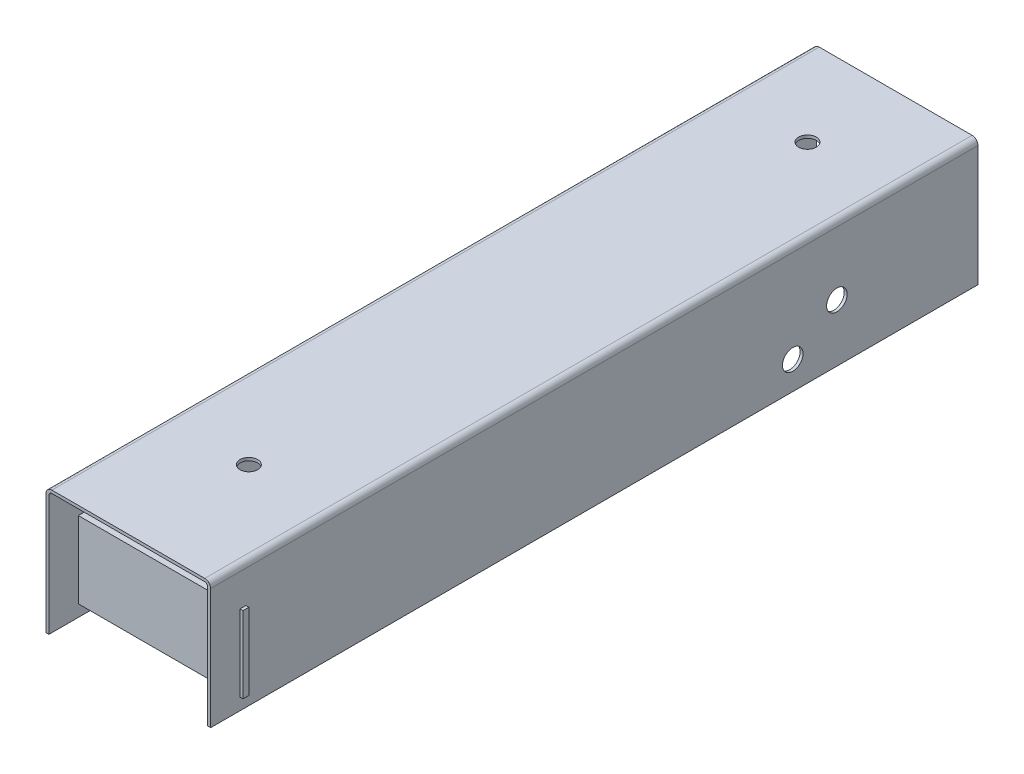
ISO-10303-21;
HEADER;
FILE_DESCRIPTION(('STEP AP214'),'2;1');
FILE_NAME('part.step','',(''),(''),'','','');
FILE_SCHEMA(('AUTOMOTIVE_DESIGN { 1 0 10303 214 1 1 1 1 }'));
ENDSEC;
DATA;
#1=APPLICATION_CONTEXT('core data for automotive mechanical design processes');
#2=APPLICATION_PROTOCOL_DEFINITION('international standard','automotive_design',2000,#1);
#3=PRODUCT_CONTEXT('',#1,'mechanical');
#4=PRODUCT('Part','Part','',(#3));
#5=PRODUCT_RELATED_PRODUCT_CATEGORY('part','',(#4));
#6=PRODUCT_DEFINITION_FORMATION('','',#4);
#7=PRODUCT_DEFINITION_CONTEXT('part definition',#1,'design');
#8=PRODUCT_DEFINITION('design','',#6,#7);
#9=PRODUCT_DEFINITION_SHAPE('','',#8);
#10=(LENGTH_UNIT() NAMED_UNIT(*) SI_UNIT(.MILLI.,.METRE.));
#11=(NAMED_UNIT(*) PLANE_ANGLE_UNIT() SI_UNIT($,.RADIAN.));
#12=(NAMED_UNIT(*) SI_UNIT($,.STERADIAN.) SOLID_ANGLE_UNIT());
#13=UNCERTAINTY_MEASURE_WITH_UNIT(LENGTH_MEASURE(1.E-05),#10,'distance_accuracy_value','');
#14=(GEOMETRIC_REPRESENTATION_CONTEXT(3) GLOBAL_UNCERTAINTY_ASSIGNED_CONTEXT((#13)) GLOBAL_UNIT_ASSIGNED_CONTEXT((#10,
#11,#12)) REPRESENTATION_CONTEXT('',''));
#15=CARTESIAN_POINT('',(0.,0.,0.));
#16=DIRECTION('',(0.,0.,1.));
#17=DIRECTION('',(1.,0.,0.));
#18=AXIS2_PLACEMENT_3D('',#15,#16,#17);
#19=CARTESIAN_POINT('',(0.,-21.5,261.));
#20=DIRECTION('',(0.,1.,0.));
#21=DIRECTION('',(0.,0.,1.));
#22=AXIS2_PLACEMENT_3D('',#19,#20,#21);
#23=PLANE('',#22);
#24=DIRECTION('',(0.,0.,-1.));
#25=VECTOR('',#24,1.);
#26=CARTESIAN_POINT('',(-27.,-21.5,261.));
#27=LINE('',#26,#25);
#28=CARTESIAN_POINT('',(-27.,-21.5,206.));
#29=VERTEX_POINT('',#28);
#30=CARTESIAN_POINT('',(-27.,-21.5,0.));
#31=VERTEX_POINT('',#30);
#32=EDGE_CURVE('E409',#29,#31,#27,.T.);
#33=ORIENTED_EDGE('',*,*,#32,.F.);
#34=DIRECTION('',(-1.,0.,0.));
#35=VECTOR('',#34,1.);
#36=CARTESIAN_POINT('',(0.,-21.5,206.));
#37=LINE('',#36,#35);
#38=CARTESIAN_POINT('',(-28.,-21.5,206.));
#39=VERTEX_POINT('',#38);
#40=EDGE_CURVE('E264',#29,#39,#37,.T.);
#41=ORIENTED_EDGE('',*,*,#40,.T.);
#42=DIRECTION('',(0.,0.,-1.));
#43=VECTOR('',#42,1.);
#44=CARTESIAN_POINT('',(-28.,-21.5,261.));
#45=LINE('',#44,#43);
#46=CARTESIAN_POINT('',(-28.,-21.5,0.));
#47=VERTEX_POINT('',#46);
#48=EDGE_CURVE('E443',#39,#47,#45,.T.);
#49=ORIENTED_EDGE('',*,*,#48,.T.);
#50=DIRECTION('',(1.,0.,0.));
#51=VECTOR('',#50,1.);
#52=CARTESIAN_POINT('',(0.,-21.5,0.));
#53=LINE('',#52,#51);
#54=EDGE_CURVE('E428',#47,#31,#53,.T.);
#55=ORIENTED_EDGE('',*,*,#54,.T.);
#56=EDGE_LOOP('',(#33,#41,#49,#55));
#57=FACE_BOUND('',#56,.T.);
#58=ADVANCED_FACE('F46',(#57),#23,.F.);
#59=CARTESIAN_POINT('',(27.,0.,261.));
#60=DIRECTION('',(-1.,0.,0.));
#61=DIRECTION('',(0.,0.,1.));
#62=AXIS2_PLACEMENT_3D('',#59,#60,#61);
#63=PLANE('',#62);
#64=CARTESIAN_POINT('',(27.,-1.99999999999999,48.));
#65=DIRECTION('',(-1.,0.,0.));
#66=DIRECTION('',(0.,0.,1.));
#67=AXIS2_PLACEMENT_3D('',#64,#65,#66);
#68=CIRCLE('',#67,3.5);
#69=CARTESIAN_POINT('',(27.,-1.99999999999999,51.5));
#70=VERTEX_POINT('',#69);
#71=EDGE_CURVE('E560',#70,#70,#68,.T.);
#72=ORIENTED_EDGE('',*,*,#71,.F.);
#73=EDGE_LOOP('',(#72));
#74=FACE_BOUND('',#73,.T.);
#75=CARTESIAN_POINT('',(27.,-12.,63.));
#76=DIRECTION('',(-1.,0.,0.));
#77=DIRECTION('',(0.,0.,1.));
#78=AXIS2_PLACEMENT_3D('',#75,#76,#77);
#79=CIRCLE('',#78,3.50000000000001);
#80=CARTESIAN_POINT('',(27.,-12.,66.5));
#81=VERTEX_POINT('',#80);
#82=EDGE_CURVE('E542',#81,#81,#79,.T.);
#83=ORIENTED_EDGE('',*,*,#82,.F.);
#84=EDGE_LOOP('',(#83));
#85=FACE_BOUND('',#84,.T.);
#86=DIRECTION('',(0.,1.,0.));
#87=VECTOR('',#86,1.);
#88=CARTESIAN_POINT('',(27.,0.,251.));
#89=LINE('',#88,#87);
#90=CARTESIAN_POINT('',(27.,-17.5,251.));
#91=VERTEX_POINT('',#90);
#92=CARTESIAN_POINT('',(27.,8.5,251.));
#93=VERTEX_POINT('',#92);
#94=EDGE_CURVE('E375',#91,#93,#89,.T.);
#95=ORIENTED_EDGE('',*,*,#94,.F.);
#96=DIRECTION('',(0.,0.,1.));
#97=VECTOR('',#96,1.);
#98=CARTESIAN_POINT('',(27.,-17.5,261.));
#99=LINE('',#98,#97);
#100=CARTESIAN_POINT('',(27.,-17.5,249.));
#101=VERTEX_POINT('',#100);
#102=EDGE_CURVE('E341',#101,#91,#99,.T.);
#103=ORIENTED_EDGE('',*,*,#102,.F.);
#104=DIRECTION('',(0.,-1.,0.));
#105=VECTOR('',#104,1.);
#106=CARTESIAN_POINT('',(27.,0.,249.));
#107=LINE('',#106,#105);
#108=CARTESIAN_POINT('',(27.,8.5,249.));
#109=VERTEX_POINT('',#108);
#110=EDGE_CURVE('E353',#109,#101,#107,.T.);
#111=ORIENTED_EDGE('',*,*,#110,.F.);
#112=DIRECTION('',(0.,0.,-1.));
#113=VECTOR('',#112,1.);
#114=CARTESIAN_POINT('',(27.,8.5,261.));
#115=LINE('',#114,#113);
#116=EDGE_CURVE('E72',#93,#109,#115,.T.);
#117=ORIENTED_EDGE('',*,*,#116,.F.);
#118=EDGE_LOOP('',(#95,#103,#111,#117));
#119=FACE_BOUND('',#118,.T.);
#120=DIRECTION('',(0.,1.,0.));
#121=VECTOR('',#120,1.);
#122=CARTESIAN_POINT('',(27.,0.,261.));
#123=LINE('',#122,#121);
#124=CARTESIAN_POINT('',(27.,-21.5,261.));
#125=VERTEX_POINT('',#124);
#126=CARTESIAN_POINT('',(27.,19.5,261.));
#127=VERTEX_POINT('',#126);
#128=EDGE_CURVE('E379',#125,#127,#123,.T.);
#129=ORIENTED_EDGE('',*,*,#128,.T.);
#130=DIRECTION('',(0.,0.,-1.));
#131=VECTOR('',#130,1.);
#132=CARTESIAN_POINT('',(27.,19.5,261.));
#133=LINE('',#132,#131);
#134=CARTESIAN_POINT('',(27.,19.5,0.));
#135=VERTEX_POINT('',#134);
#136=EDGE_CURVE('E480',#127,#135,#133,.T.);
#137=ORIENTED_EDGE('',*,*,#136,.T.);
#138=DIRECTION('',(0.,1.,0.));
#139=VECTOR('',#138,1.);
#140=CARTESIAN_POINT('',(27.,0.,0.));
#141=LINE('',#140,#139);
#142=CARTESIAN_POINT('',(27.,-21.5,0.));
#143=VERTEX_POINT('',#142);
#144=EDGE_CURVE('E378',#143,#135,#141,.T.);
#145=ORIENTED_EDGE('',*,*,#144,.F.);
#146=DIRECTION('',(0.,0.,-1.));
#147=VECTOR('',#146,1.);
#148=CARTESIAN_POINT('',(27.,-21.5,261.));
#149=LINE('',#148,#147);
#150=EDGE_CURVE('E451',#125,#143,#149,.T.);
#151=ORIENTED_EDGE('',*,*,#150,.F.);
#152=EDGE_LOOP('',(#129,#137,#145,#151));
#153=FACE_BOUND('',#152,.T.);
#154=ADVANCED_FACE('F624',(#74,#85,#119,#153),#63,.T.);
#155=CARTESIAN_POINT('',(0.,-21.5,261.));
#156=DIRECTION('',(0.,-1.,0.));
#157=DIRECTION('',(0.,0.,-1.));
#158=AXIS2_PLACEMENT_3D('',#155,#156,#157);
#159=PLANE('',#158);
#160=DIRECTION('',(-1.,0.,0.));
#161=VECTOR('',#160,1.);
#162=CARTESIAN_POINT('',(0.,-21.5,0.));
#163=LINE('',#162,#161);
#164=CARTESIAN_POINT('',(28.,-21.5,0.));
#165=VERTEX_POINT('',#164);
#166=EDGE_CURVE('E413',#165,#143,#163,.T.);
#167=ORIENTED_EDGE('',*,*,#166,.F.);
#168=DIRECTION('',(0.,0.,-1.));
#169=VECTOR('',#168,1.);
#170=CARTESIAN_POINT('',(28.,-21.5,261.));
#171=LINE('',#170,#169);
#172=CARTESIAN_POINT('',(28.,-21.5,261.));
#173=VERTEX_POINT('',#172);
#174=EDGE_CURVE('E447',#173,#165,#171,.T.);
#175=ORIENTED_EDGE('',*,*,#174,.F.);
#176=DIRECTION('',(-1.,0.,0.));
#177=VECTOR('',#176,1.);
#178=CARTESIAN_POINT('',(0.,-21.5,261.));
#179=LINE('',#178,#177);
#180=EDGE_CURVE('E383',#173,#125,#179,.T.);
#181=ORIENTED_EDGE('',*,*,#180,.T.);
#182=ORIENTED_EDGE('',*,*,#150,.T.);
#183=EDGE_LOOP('',(#167,#175,#181,#182));
#184=FACE_BOUND('',#183,.T.);
#185=ADVANCED_FACE('F632',(#184),#159,.T.);
#186=CARTESIAN_POINT('',(28.,0.,261.));
#187=DIRECTION('',(1.,0.,0.));
#188=DIRECTION('',(0.,1.,0.));
#189=AXIS2_PLACEMENT_3D('',#186,#187,#188);
#190=PLANE('',#189);
#191=CARTESIAN_POINT('',(28.,-1.99999999999999,48.));
#192=DIRECTION('',(1.,0.,0.));
#193=DIRECTION('',(0.,1.,0.));
#194=AXIS2_PLACEMENT_3D('',#191,#192,#193);
#195=CIRCLE('',#194,3.5);
#196=CARTESIAN_POINT('',(28.,1.50000000000001,48.));
#197=VERTEX_POINT('',#196);
#198=EDGE_CURVE('E556',#197,#197,#195,.T.);
#199=ORIENTED_EDGE('',*,*,#198,.F.);
#200=EDGE_LOOP('',(#199));
#201=FACE_BOUND('',#200,.T.);
#202=CARTESIAN_POINT('',(28.,-12.,63.));
#203=DIRECTION('',(1.,0.,0.));
#204=DIRECTION('',(0.,1.,0.));
#205=AXIS2_PLACEMENT_3D('',#202,#203,#204);
#206=CIRCLE('',#205,3.50000000000001);
#207=CARTESIAN_POINT('',(28.,-8.49999999999999,63.));
#208=VERTEX_POINT('',#207);
#209=EDGE_CURVE('E535',#208,#208,#206,.T.);
#210=ORIENTED_EDGE('',*,*,#209,.F.);
#211=EDGE_LOOP('',(#210));
#212=FACE_BOUND('',#211,.T.);
#213=DIRECTION('',(0.,-1.,0.));
#214=VECTOR('',#213,1.);
#215=CARTESIAN_POINT('',(28.,0.,251.));
#216=LINE('',#215,#214);
#217=CARTESIAN_POINT('',(28.,8.5,251.));
#218=VERTEX_POINT('',#217);
#219=CARTESIAN_POINT('',(28.,-17.5,251.));
#220=VERTEX_POINT('',#219);
#221=EDGE_CURVE('E371',#218,#220,#216,.T.);
#222=ORIENTED_EDGE('',*,*,#221,.F.);
#223=DIRECTION('',(0.,0.,1.));
#224=VECTOR('',#223,1.);
#225=CARTESIAN_POINT('',(28.,8.5,261.));
#226=LINE('',#225,#224);
#227=CARTESIAN_POINT('',(28.,8.5,249.));
#228=VERTEX_POINT('',#227);
#229=EDGE_CURVE('E361',#228,#218,#226,.T.);
#230=ORIENTED_EDGE('',*,*,#229,.F.);
#231=DIRECTION('',(0.,1.,0.));
#232=VECTOR('',#231,1.);
#233=CARTESIAN_POINT('',(28.,0.,249.));
#234=LINE('',#233,#232);
#235=CARTESIAN_POINT('',(28.,-17.5,249.));
#236=VERTEX_POINT('',#235);
#237=EDGE_CURVE('E349',#236,#228,#234,.T.);
#238=ORIENTED_EDGE('',*,*,#237,.F.);
#239=DIRECTION('',(0.,0.,-1.));
#240=VECTOR('',#239,1.);
#241=CARTESIAN_POINT('',(28.,-17.5,261.));
#242=LINE('',#241,#240);
#243=EDGE_CURVE('E337',#220,#236,#242,.T.);
#244=ORIENTED_EDGE('',*,*,#243,.F.);
#245=EDGE_LOOP('',(#222,#230,#238,#244));
#246=FACE_BOUND('',#245,.T.);
#247=DIRECTION('',(0.,-1.,0.));
#248=VECTOR('',#247,1.);
#249=CARTESIAN_POINT('',(28.,0.,0.));
#250=LINE('',#249,#248);
#251=CARTESIAN_POINT('',(28.,19.5,0.));
#252=VERTEX_POINT('',#251);
#253=EDGE_CURVE('E417',#252,#165,#250,.T.);
#254=ORIENTED_EDGE('',*,*,#253,.F.);
#255=DIRECTION('',(0.,0.,-1.));
#256=VECTOR('',#255,1.);
#257=CARTESIAN_POINT('',(28.,19.5,261.));
#258=LINE('',#257,#256);
#259=CARTESIAN_POINT('',(28.,19.5,261.));
#260=VERTEX_POINT('',#259);
#261=EDGE_CURVE('E477',#252,#260,#258,.F.);
#262=ORIENTED_EDGE('',*,*,#261,.T.);
#263=DIRECTION('',(0.,-1.,0.));
#264=VECTOR('',#263,1.);
#265=CARTESIAN_POINT('',(28.,0.,261.));
#266=LINE('',#265,#264);
#267=EDGE_CURVE('E388',#260,#173,#266,.T.);
#268=ORIENTED_EDGE('',*,*,#267,.T.);
#269=ORIENTED_EDGE('',*,*,#174,.T.);
#270=EDGE_LOOP('',(#254,#262,#268,#269));
#271=FACE_BOUND('',#270,.T.);
#272=ADVANCED_FACE('F601',(#201,#212,#246,#271),#190,.T.);
#273=CARTESIAN_POINT('',(0.,21.5,261.));
#274=DIRECTION('',(0.,1.,0.));
#275=DIRECTION('',(0.,0.,1.));
#276=AXIS2_PLACEMENT_3D('',#273,#274,#275);
#277=PLANE('',#276);
#278=CARTESIAN_POINT('',(0.,21.5,30.));
#279=DIRECTION('',(0.,1.,0.));
#280=DIRECTION('',(0.,0.,1.));
#281=AXIS2_PLACEMENT_3D('',#278,#279,#280);
#282=CIRCLE('',#281,3.);
#283=CARTESIAN_POINT('',(0.,21.5,33.));
#284=VERTEX_POINT('',#283);
#285=EDGE_CURVE('E269',#284,#284,#282,.T.);
#286=ORIENTED_EDGE('',*,*,#285,.F.);
#287=EDGE_LOOP('',(#286));
#288=FACE_BOUND('',#287,.T.);
#289=CARTESIAN_POINT('',(0.,21.5,220.));
#290=DIRECTION('',(0.,1.,0.));
#291=DIRECTION('',(0.,0.,1.));
#292=AXIS2_PLACEMENT_3D('',#289,#290,#291);
#293=CIRCLE('',#292,3.);
#294=CARTESIAN_POINT('',(0.,21.5,223.));
#295=VERTEX_POINT('',#294);
#296=EDGE_CURVE('E268',#295,#295,#293,.T.);
#297=ORIENTED_EDGE('',*,*,#296,.F.);
#298=EDGE_LOOP('',(#297));
#299=FACE_BOUND('',#298,.T.);
#300=DIRECTION('',(1.,0.,0.));
#301=VECTOR('',#300,1.);
#302=CARTESIAN_POINT('',(0.,21.5,0.));
#303=LINE('',#302,#301);
#304=CARTESIAN_POINT('',(-26.,21.5,0.));
#305=VERTEX_POINT('',#304);
#306=CARTESIAN_POINT('',(26.,21.5,0.));
#307=VERTEX_POINT('',#306);
#308=EDGE_CURVE('E420',#305,#307,#303,.T.);
#309=ORIENTED_EDGE('',*,*,#308,.F.);
#310=DIRECTION('',(0.,0.,-1.));
#311=VECTOR('',#310,1.);
#312=CARTESIAN_POINT('',(-26.,21.5,261.));
#313=LINE('',#312,#311);
#314=CARTESIAN_POINT('',(-26.,21.5,261.));
#315=VERTEX_POINT('',#314);
#316=EDGE_CURVE('E468',#305,#315,#313,.F.);
#317=ORIENTED_EDGE('',*,*,#316,.T.);
#318=DIRECTION('',(1.,0.,0.));
#319=VECTOR('',#318,1.);
#320=CARTESIAN_POINT('',(0.,21.5,261.));
#321=LINE('',#320,#319);
#322=CARTESIAN_POINT('',(26.,21.5,261.));
#323=VERTEX_POINT('',#322);
#324=EDGE_CURVE('E391',#315,#323,#321,.T.);
#325=ORIENTED_EDGE('',*,*,#324,.T.);
#326=DIRECTION('',(0.,0.,-1.));
#327=VECTOR('',#326,1.);
#328=CARTESIAN_POINT('',(26.,21.5,261.));
#329=LINE('',#328,#327);
#330=EDGE_CURVE('E464',#323,#307,#329,.T.);
#331=ORIENTED_EDGE('',*,*,#330,.T.);
#332=EDGE_LOOP('',(#309,#317,#325,#331));
#333=FACE_BOUND('',#332,.T.);
#334=ADVANCED_FACE('F646',(#288,#299,#333),#277,.T.);
#335=CARTESIAN_POINT('',(-28.,0.,261.));
#336=DIRECTION('',(1.,0.,0.));
#337=DIRECTION('',(0.,1.,0.));
#338=AXIS2_PLACEMENT_3D('',#335,#336,#337);
#339=PLANE('',#338);
#340=CARTESIAN_POINT('',(-28.,-2.,48.));
#341=DIRECTION('',(-1.,0.,0.));
#342=DIRECTION('',(0.,-1.,0.));
#343=AXIS2_PLACEMENT_3D('',#340,#341,#342);
#344=CIRCLE('',#343,3.5);
#345=CARTESIAN_POINT('',(-28.,-5.5,48.));
#346=VERTEX_POINT('',#345);
#347=EDGE_CURVE('E536',#346,#346,#344,.T.);
#348=ORIENTED_EDGE('',*,*,#347,.F.);
#349=EDGE_LOOP('',(#348));
#350=FACE_BOUND('',#349,.T.);
#351=CARTESIAN_POINT('',(-28.,-12.,63.));
#352=DIRECTION('',(-1.,0.,0.));
#353=DIRECTION('',(0.,-1.,0.));
#354=AXIS2_PLACEMENT_3D('',#351,#352,#353);
#355=CIRCLE('',#354,3.50000000000001);
#356=CARTESIAN_POINT('',(-28.,-15.5,63.));
#357=VERTEX_POINT('',#356);
#358=EDGE_CURVE('E545',#357,#357,#355,.T.);
#359=ORIENTED_EDGE('',*,*,#358,.F.);
#360=EDGE_LOOP('',(#359));
#361=FACE_BOUND('',#360,.T.);
#362=DIRECTION('',(0.,0.,1.));
#363=VECTOR('',#362,1.);
#364=CARTESIAN_POINT('',(-28.,8.5,261.));
#365=LINE('',#364,#363);
#366=CARTESIAN_POINT('',(-28.,8.5,249.));
#367=VERTEX_POINT('',#366);
#368=CARTESIAN_POINT('',(-28.,8.5,251.));
#369=VERTEX_POINT('',#368);
#370=EDGE_CURVE('E357',#367,#369,#365,.T.);
#371=ORIENTED_EDGE('',*,*,#370,.T.);
#372=DIRECTION('',(0.,-1.,0.));
#373=VECTOR('',#372,1.);
#374=CARTESIAN_POINT('',(-28.,0.,251.));
#375=LINE('',#374,#373);
#376=CARTESIAN_POINT('',(-28.,-17.5,251.));
#377=VERTEX_POINT('',#376);
#378=EDGE_CURVE('E367',#369,#377,#375,.T.);
#379=ORIENTED_EDGE('',*,*,#378,.T.);
#380=DIRECTION('',(0.,0.,-1.));
#381=VECTOR('',#380,1.);
#382=CARTESIAN_POINT('',(-28.,-17.5,261.));
#383=LINE('',#382,#381);
#384=CARTESIAN_POINT('',(-28.,-17.5,249.));
#385=VERTEX_POINT('',#384);
#386=EDGE_CURVE('E315',#377,#385,#383,.T.);
#387=ORIENTED_EDGE('',*,*,#386,.T.);
#388=DIRECTION('',(0.,1.,0.));
#389=VECTOR('',#388,1.);
#390=CARTESIAN_POINT('',(-28.,0.,249.));
#391=LINE('',#390,#389);
#392=EDGE_CURVE('E345',#385,#367,#391,.T.);
#393=ORIENTED_EDGE('',*,*,#392,.T.);
#394=EDGE_LOOP('',(#371,#379,#387,#393));
#395=FACE_BOUND('',#394,.T.);
#396=ORIENTED_EDGE('',*,*,#48,.F.);
#397=DIRECTION('',(0.,-1.,0.));
#398=VECTOR('',#397,1.);
#399=CARTESIAN_POINT('',(-28.,16.5,206.));
#400=LINE('',#399,#398);
#401=CARTESIAN_POINT('',(-28.,16.5,206.));
#402=VERTEX_POINT('',#401);
#403=EDGE_CURVE('E252',#402,#39,#400,.T.);
#404=ORIENTED_EDGE('',*,*,#403,.F.);
#405=DIRECTION('',(0.,0.,-1.));
#406=VECTOR('',#405,1.);
#407=CARTESIAN_POINT('',(-28.,16.5,206.));
#408=LINE('',#407,#406);
#409=CARTESIAN_POINT('',(-28.,16.5,236.));
#410=VERTEX_POINT('',#409);
#411=EDGE_CURVE('E236',#410,#402,#408,.T.);
#412=ORIENTED_EDGE('',*,*,#411,.F.);
#413=DIRECTION('',(0.,1.,0.));
#414=VECTOR('',#413,1.);
#415=CARTESIAN_POINT('',(-28.,16.5,236.));
#416=LINE('',#415,#414);
#417=CARTESIAN_POINT('',(-28.,-21.5,236.));
#418=VERTEX_POINT('',#417);
#419=EDGE_CURVE('E244',#418,#410,#416,.T.);
#420=ORIENTED_EDGE('',*,*,#419,.F.);
#421=CARTESIAN_POINT('',(-28.,-21.5,261.));
#422=VERTEX_POINT('',#421);
#423=EDGE_CURVE('E444',#422,#418,#45,.T.);
#424=ORIENTED_EDGE('',*,*,#423,.F.);
#425=DIRECTION('',(0.,-1.,0.));
#426=VECTOR('',#425,1.);
#427=CARTESIAN_POINT('',(-28.,0.,261.));
#428=LINE('',#427,#426);
#429=CARTESIAN_POINT('',(-28.,19.5,261.));
#430=VERTEX_POINT('',#429);
#431=EDGE_CURVE('E395',#430,#422,#428,.T.);
#432=ORIENTED_EDGE('',*,*,#431,.F.);
#433=DIRECTION('',(0.,0.,-1.));
#434=VECTOR('',#433,1.);
#435=CARTESIAN_POINT('',(-28.,19.5,0.));
#436=LINE('',#435,#434);
#437=CARTESIAN_POINT('',(-28.,19.5,0.));
#438=VERTEX_POINT('',#437);
#439=EDGE_CURVE('E454',#430,#438,#436,.T.);
#440=ORIENTED_EDGE('',*,*,#439,.T.);
#441=DIRECTION('',(0.,-1.,0.));
#442=VECTOR('',#441,1.);
#443=CARTESIAN_POINT('',(-28.,0.,0.));
#444=LINE('',#443,#442);
#445=EDGE_CURVE('E424',#438,#47,#444,.T.);
#446=ORIENTED_EDGE('',*,*,#445,.T.);
#447=EDGE_LOOP('',(#396,#404,#412,#420,#424,#432,#440,#446));
#448=FACE_BOUND('',#447,.T.);
#449=ADVANCED_FACE('F255',(#350,#361,#395,#448),#339,.F.);
#450=ORIENTED_EDGE('',*,*,#423,.T.);
#451=DIRECTION('',(1.,0.,0.));
#452=VECTOR('',#451,1.);
#453=CARTESIAN_POINT('',(0.,-21.5,236.));
#454=LINE('',#453,#452);
#455=CARTESIAN_POINT('',(-27.,-21.5,236.));
#456=VERTEX_POINT('',#455);
#457=EDGE_CURVE('E247',#418,#456,#454,.T.);
#458=ORIENTED_EDGE('',*,*,#457,.T.);
#459=CARTESIAN_POINT('',(-27.,-21.5,261.));
#460=VERTEX_POINT('',#459);
#461=EDGE_CURVE('E439',#460,#456,#27,.T.);
#462=ORIENTED_EDGE('',*,*,#461,.F.);
#463=DIRECTION('',(1.,0.,0.));
#464=VECTOR('',#463,1.);
#465=CARTESIAN_POINT('',(0.,-21.5,261.));
#466=LINE('',#465,#464);
#467=EDGE_CURVE('E398',#422,#460,#466,.T.);
#468=ORIENTED_EDGE('',*,*,#467,.F.);
#469=EDGE_LOOP('',(#450,#458,#462,#468));
#470=FACE_BOUND('',#469,.T.);
#471=ADVANCED_FACE('F626',(#470),#23,.F.);
#472=CARTESIAN_POINT('',(-27.,0.,261.));
#473=DIRECTION('',(-1.,0.,0.));
#474=DIRECTION('',(0.,0.,1.));
#475=AXIS2_PLACEMENT_3D('',#472,#473,#474);
#476=PLANE('',#475);
#477=CARTESIAN_POINT('',(-27.,-2.,48.));
#478=DIRECTION('',(-1.,0.,0.));
#479=DIRECTION('',(0.,0.,1.));
#480=AXIS2_PLACEMENT_3D('',#477,#478,#479);
#481=CIRCLE('',#480,3.5);
#482=CARTESIAN_POINT('',(-27.,-2.,51.5));
#483=VERTEX_POINT('',#482);
#484=EDGE_CURVE('E50',#483,#483,#481,.T.);
#485=ORIENTED_EDGE('',*,*,#484,.T.);
#486=EDGE_LOOP('',(#485));
#487=FACE_BOUND('',#486,.T.);
#488=CARTESIAN_POINT('',(-27.,-12.,63.));
#489=DIRECTION('',(-1.,0.,0.));
#490=DIRECTION('',(0.,0.,1.));
#491=AXIS2_PLACEMENT_3D('',#488,#489,#490);
#492=CIRCLE('',#491,3.50000000000001);
#493=CARTESIAN_POINT('',(-27.,-12.,66.5));
#494=VERTEX_POINT('',#493);
#495=EDGE_CURVE('E532',#494,#494,#492,.T.);
#496=ORIENTED_EDGE('',*,*,#495,.T.);
#497=EDGE_LOOP('',(#496));
#498=FACE_BOUND('',#497,.T.);
#499=DIRECTION('',(0.,0.,1.));
#500=VECTOR('',#499,1.);
#501=CARTESIAN_POINT('',(-27.,-17.5,261.));
#502=LINE('',#501,#500);
#503=CARTESIAN_POINT('',(-27.,-17.5,249.));
#504=VERTEX_POINT('',#503);
#505=CARTESIAN_POINT('',(-27.,-17.5,251.));
#506=VERTEX_POINT('',#505);
#507=EDGE_CURVE('E506',#504,#506,#502,.T.);
#508=ORIENTED_EDGE('',*,*,#507,.T.);
#509=DIRECTION('',(0.,1.,0.));
#510=VECTOR('',#509,1.);
#511=CARTESIAN_POINT('',(-27.,0.,251.));
#512=LINE('',#511,#510);
#513=CARTESIAN_POINT('',(-27.,8.5,251.));
#514=VERTEX_POINT('',#513);
#515=EDGE_CURVE('E518',#506,#514,#512,.T.);
#516=ORIENTED_EDGE('',*,*,#515,.T.);
#517=DIRECTION('',(0.,0.,-1.));
#518=VECTOR('',#517,1.);
#519=CARTESIAN_POINT('',(-27.,8.5,261.));
#520=LINE('',#519,#518);
#521=CARTESIAN_POINT('',(-27.,8.5,249.));
#522=VERTEX_POINT('',#521);
#523=EDGE_CURVE('E514',#514,#522,#520,.T.);
#524=ORIENTED_EDGE('',*,*,#523,.T.);
#525=DIRECTION('',(0.,-1.,0.));
#526=VECTOR('',#525,1.);
#527=CARTESIAN_POINT('',(-27.,0.,249.));
#528=LINE('',#527,#526);
#529=EDGE_CURVE('E510',#522,#504,#528,.T.);
#530=ORIENTED_EDGE('',*,*,#529,.T.);
#531=EDGE_LOOP('',(#508,#516,#524,#530));
#532=FACE_BOUND('',#531,.T.);
#533=DIRECTION('',(0.,0.,-1.));
#534=VECTOR('',#533,1.);
#535=CARTESIAN_POINT('',(-27.,16.5,261.));
#536=LINE('',#535,#534);
#537=CARTESIAN_POINT('',(-27.,16.5,236.));
#538=VERTEX_POINT('',#537);
#539=CARTESIAN_POINT('',(-27.,16.5,206.));
#540=VERTEX_POINT('',#539);
#541=EDGE_CURVE('E56',#538,#540,#536,.T.);
#542=ORIENTED_EDGE('',*,*,#541,.T.);
#543=DIRECTION('',(0.,-1.,0.));
#544=VECTOR('',#543,1.);
#545=CARTESIAN_POINT('',(-27.,0.,206.));
#546=LINE('',#545,#544);
#547=EDGE_CURVE('E11',#540,#29,#546,.T.);
#548=ORIENTED_EDGE('',*,*,#547,.T.);
#549=ORIENTED_EDGE('',*,*,#32,.T.);
#550=DIRECTION('',(0.,1.,0.));
#551=VECTOR('',#550,1.);
#552=CARTESIAN_POINT('',(-27.,0.,0.));
#553=LINE('',#552,#551);
#554=CARTESIAN_POINT('',(-27.,19.5,0.));
#555=VERTEX_POINT('',#554);
#556=EDGE_CURVE('E432',#31,#555,#553,.T.);
#557=ORIENTED_EDGE('',*,*,#556,.T.);
#558=DIRECTION('',(0.,0.,-1.));
#559=VECTOR('',#558,1.);
#560=CARTESIAN_POINT('',(-27.,19.5,261.));
#561=LINE('',#560,#559);
#562=CARTESIAN_POINT('',(-27.,19.5,261.));
#563=VERTEX_POINT('',#562);
#564=EDGE_CURVE('E491',#555,#563,#561,.F.);
#565=ORIENTED_EDGE('',*,*,#564,.T.);
#566=DIRECTION('',(0.,1.,0.));
#567=VECTOR('',#566,1.);
#568=CARTESIAN_POINT('',(-27.,0.,261.));
#569=LINE('',#568,#567);
#570=EDGE_CURVE('E401',#460,#563,#569,.T.);
#571=ORIENTED_EDGE('',*,*,#570,.F.);
#572=ORIENTED_EDGE('',*,*,#461,.T.);
#573=DIRECTION('',(0.,1.,0.));
#574=VECTOR('',#573,1.);
#575=CARTESIAN_POINT('',(-27.,0.,236.));
#576=LINE('',#575,#574);
#577=EDGE_CURVE('E522',#456,#538,#576,.T.);
#578=ORIENTED_EDGE('',*,*,#577,.T.);
#579=EDGE_LOOP('',(#542,#548,#549,#557,#565,#571,#572,#578));
#580=FACE_BOUND('',#579,.T.);
#581=ADVANCED_FACE('F637',(#487,#498,#532,#580),#476,.F.);
#582=CARTESIAN_POINT('',(0.,20.5,261.));
#583=DIRECTION('',(0.,1.,0.));
#584=DIRECTION('',(0.,0.,1.));
#585=AXIS2_PLACEMENT_3D('',#582,#583,#584);
#586=PLANE('',#585);
#587=CARTESIAN_POINT('',(0.,20.5,30.));
#588=DIRECTION('',(0.,1.,0.));
#589=DIRECTION('',(0.,0.,1.));
#590=AXIS2_PLACEMENT_3D('',#587,#588,#589);
#591=CIRCLE('',#590,3.);
#592=CARTESIAN_POINT('',(0.,20.5,33.));
#593=VERTEX_POINT('',#592);
#594=EDGE_CURVE('E282',#593,#593,#591,.T.);
#595=ORIENTED_EDGE('',*,*,#594,.T.);
#596=EDGE_LOOP('',(#595));
#597=FACE_BOUND('',#596,.T.);
#598=CARTESIAN_POINT('',(0.,20.5,220.));
#599=DIRECTION('',(0.,1.,0.));
#600=DIRECTION('',(0.,0.,1.));
#601=AXIS2_PLACEMENT_3D('',#598,#599,#600);
#602=CIRCLE('',#601,3.);
#603=CARTESIAN_POINT('',(0.,20.5,223.));
#604=VERTEX_POINT('',#603);
#605=EDGE_CURVE('E273',#604,#604,#602,.T.);
#606=ORIENTED_EDGE('',*,*,#605,.T.);
#607=EDGE_LOOP('',(#606));
#608=FACE_BOUND('',#607,.T.);
#609=DIRECTION('',(1.,0.,0.));
#610=VECTOR('',#609,1.);
#611=CARTESIAN_POINT('',(0.,20.5,0.));
#612=LINE('',#611,#610);
#613=CARTESIAN_POINT('',(-26.,20.5,0.));
#614=VERTEX_POINT('',#613);
#615=CARTESIAN_POINT('',(26.,20.5,0.));
#616=VERTEX_POINT('',#615);
#617=EDGE_CURVE('E384',#614,#616,#612,.T.);
#618=ORIENTED_EDGE('',*,*,#617,.T.);
#619=DIRECTION('',(0.,0.,-1.));
#620=VECTOR('',#619,1.);
#621=CARTESIAN_POINT('',(26.,20.5,261.));
#622=LINE('',#621,#620);
#623=CARTESIAN_POINT('',(26.,20.5,261.));
#624=VERTEX_POINT('',#623);
#625=EDGE_CURVE('E488',#616,#624,#622,.F.);
#626=ORIENTED_EDGE('',*,*,#625,.T.);
#627=DIRECTION('',(1.,0.,0.));
#628=VECTOR('',#627,1.);
#629=CARTESIAN_POINT('',(0.,20.5,261.));
#630=LINE('',#629,#628);
#631=CARTESIAN_POINT('',(-26.,20.5,261.));
#632=VERTEX_POINT('',#631);
#633=EDGE_CURVE('E405',#632,#624,#630,.T.);
#634=ORIENTED_EDGE('',*,*,#633,.F.);
#635=DIRECTION('',(0.,0.,-1.));
#636=VECTOR('',#635,1.);
#637=CARTESIAN_POINT('',(-26.,20.5,0.));
#638=LINE('',#637,#636);
#639=EDGE_CURVE('E484',#632,#614,#638,.T.);
#640=ORIENTED_EDGE('',*,*,#639,.T.);
#641=EDGE_LOOP('',(#618,#626,#634,#640));
#642=FACE_BOUND('',#641,.T.);
#643=ADVANCED_FACE('F643',(#597,#608,#642),#586,.F.);
#644=CARTESIAN_POINT('',(0.,0.,261.));
#645=DIRECTION('',(0.,0.,1.));
#646=DIRECTION('',(1.,0.,0.));
#647=AXIS2_PLACEMENT_3D('',#644,#645,#646);
#648=PLANE('',#647);
#649=ORIENTED_EDGE('',*,*,#324,.F.);
#650=CARTESIAN_POINT('',(-26.,19.5,261.));
#651=DIRECTION('',(0.,0.,1.));
#652=DIRECTION('',(1.,0.,0.));
#653=AXIS2_PLACEMENT_3D('',#650,#651,#652);
#654=CIRCLE('',#653,2.);
#655=EDGE_CURVE('E474',#315,#430,#654,.T.);
#656=ORIENTED_EDGE('',*,*,#655,.T.);
#657=ORIENTED_EDGE('',*,*,#431,.T.);
#658=ORIENTED_EDGE('',*,*,#467,.T.);
#659=ORIENTED_EDGE('',*,*,#570,.T.);
#660=CARTESIAN_POINT('',(-26.,19.5,261.));
#661=DIRECTION('',(0.,0.,1.));
#662=DIRECTION('',(1.,0.,0.));
#663=AXIS2_PLACEMENT_3D('',#660,#661,#662);
#664=CIRCLE('',#663,1.);
#665=EDGE_CURVE('E503',#563,#632,#664,.F.);
#666=ORIENTED_EDGE('',*,*,#665,.T.);
#667=ORIENTED_EDGE('',*,*,#633,.T.);
#668=CARTESIAN_POINT('',(26.,19.5,261.));
#669=DIRECTION('',(0.,0.,1.));
#670=DIRECTION('',(1.,0.,0.));
#671=AXIS2_PLACEMENT_3D('',#668,#669,#670);
#672=CIRCLE('',#671,1.);
#673=EDGE_CURVE('E497',#624,#127,#672,.F.);
#674=ORIENTED_EDGE('',*,*,#673,.T.);
#675=ORIENTED_EDGE('',*,*,#128,.F.);
#676=ORIENTED_EDGE('',*,*,#180,.F.);
#677=ORIENTED_EDGE('',*,*,#267,.F.);
#678=CARTESIAN_POINT('',(26.,19.5,261.));
#679=DIRECTION('',(0.,0.,1.));
#680=DIRECTION('',(1.,0.,0.));
#681=AXIS2_PLACEMENT_3D('',#678,#679,#680);
#682=CIRCLE('',#681,2.);
#683=EDGE_CURVE('E471',#260,#323,#682,.T.);
#684=ORIENTED_EDGE('',*,*,#683,.T.);
#685=EDGE_LOOP('',(#649,#656,#657,#658,#659,#666,#667,#674,#675,#676,#677,#684));
#686=FACE_BOUND('',#685,.T.);
#687=ADVANCED_FACE('F685',(#686),#648,.T.);
#688=CARTESIAN_POINT('',(0.,0.,0.));
#689=DIRECTION('',(0.,0.,1.));
#690=DIRECTION('',(1.,0.,0.));
#691=AXIS2_PLACEMENT_3D('',#688,#689,#690);
#692=PLANE('',#691);
#693=ORIENTED_EDGE('',*,*,#445,.F.);
#694=CARTESIAN_POINT('',(-26.,19.5,0.));
#695=DIRECTION('',(0.,0.,1.));
#696=DIRECTION('',(1.,0.,0.));
#697=AXIS2_PLACEMENT_3D('',#694,#695,#696);
#698=CIRCLE('',#697,2.);
#699=EDGE_CURVE('E461',#438,#305,#698,.F.);
#700=ORIENTED_EDGE('',*,*,#699,.T.);
#701=ORIENTED_EDGE('',*,*,#308,.T.);
#702=CARTESIAN_POINT('',(26.,19.5,0.));
#703=DIRECTION('',(0.,0.,1.));
#704=DIRECTION('',(1.,0.,0.));
#705=AXIS2_PLACEMENT_3D('',#702,#703,#704);
#706=CIRCLE('',#705,2.);
#707=EDGE_CURVE('E458',#307,#252,#706,.F.);
#708=ORIENTED_EDGE('',*,*,#707,.T.);
#709=ORIENTED_EDGE('',*,*,#253,.T.);
#710=ORIENTED_EDGE('',*,*,#166,.T.);
#711=ORIENTED_EDGE('',*,*,#144,.T.);
#712=CARTESIAN_POINT('',(26.,19.5,0.));
#713=DIRECTION('',(0.,0.,1.));
#714=DIRECTION('',(1.,0.,0.));
#715=AXIS2_PLACEMENT_3D('',#712,#713,#714);
#716=CIRCLE('',#715,1.);
#717=EDGE_CURVE('E494',#135,#616,#716,.T.);
#718=ORIENTED_EDGE('',*,*,#717,.T.);
#719=ORIENTED_EDGE('',*,*,#617,.F.);
#720=CARTESIAN_POINT('',(-26.,19.5,0.));
#721=DIRECTION('',(0.,0.,1.));
#722=DIRECTION('',(1.,0.,0.));
#723=AXIS2_PLACEMENT_3D('',#720,#721,#722);
#724=CIRCLE('',#723,1.);
#725=EDGE_CURVE('E500',#614,#555,#724,.T.);
#726=ORIENTED_EDGE('',*,*,#725,.T.);
#727=ORIENTED_EDGE('',*,*,#556,.F.);
#728=ORIENTED_EDGE('',*,*,#54,.F.);
#729=EDGE_LOOP('',(#693,#700,#701,#708,#709,#710,#711,#718,#719,#726,#727,#728));
#730=FACE_BOUND('',#729,.T.);
#731=ADVANCED_FACE('F659',(#730),#692,.F.);
#732=CARTESIAN_POINT('',(-26.,19.5,261.));
#733=DIRECTION('',(0.,0.,1.));
#734=DIRECTION('',(1.,0.,0.));
#735=AXIS2_PLACEMENT_3D('',#732,#733,#734);
#736=CYLINDRICAL_SURFACE('',#735,2.);
#737=ORIENTED_EDGE('',*,*,#655,.F.);
#738=ORIENTED_EDGE('',*,*,#316,.F.);
#739=ORIENTED_EDGE('',*,*,#699,.F.);
#740=ORIENTED_EDGE('',*,*,#439,.F.);
#741=EDGE_LOOP('',(#737,#738,#739,#740));
#742=FACE_BOUND('',#741,.T.);
#743=ADVANCED_FACE('F655',(#742),#736,.T.);
#744=CARTESIAN_POINT('',(26.,19.5,261.));
#745=DIRECTION('',(0.,0.,-1.));
#746=DIRECTION('',(-1.,0.,0.));
#747=AXIS2_PLACEMENT_3D('',#744,#745,#746);
#748=CYLINDRICAL_SURFACE('',#747,2.);
#749=ORIENTED_EDGE('',*,*,#683,.F.);
#750=ORIENTED_EDGE('',*,*,#261,.F.);
#751=ORIENTED_EDGE('',*,*,#707,.F.);
#752=ORIENTED_EDGE('',*,*,#330,.F.);
#753=EDGE_LOOP('',(#749,#750,#751,#752));
#754=FACE_BOUND('',#753,.T.);
#755=ADVANCED_FACE('F665',(#754),#748,.T.);
#756=CARTESIAN_POINT('',(26.,19.5,261.));
#757=DIRECTION('',(0.,0.,-1.));
#758=DIRECTION('',(-1.,0.,0.));
#759=AXIS2_PLACEMENT_3D('',#756,#757,#758);
#760=CYLINDRICAL_SURFACE('',#759,1.);
#761=ORIENTED_EDGE('',*,*,#673,.F.);
#762=ORIENTED_EDGE('',*,*,#625,.F.);
#763=ORIENTED_EDGE('',*,*,#717,.F.);
#764=ORIENTED_EDGE('',*,*,#136,.F.);
#765=EDGE_LOOP('',(#761,#762,#763,#764));
#766=FACE_BOUND('',#765,.T.);
#767=ADVANCED_FACE('F680',(#766),#760,.F.);
#768=CARTESIAN_POINT('',(-26.,19.5,261.));
#769=DIRECTION('',(0.,0.,1.));
#770=DIRECTION('',(1.,0.,0.));
#771=AXIS2_PLACEMENT_3D('',#768,#769,#770);
#772=CYLINDRICAL_SURFACE('',#771,1.);
#773=ORIENTED_EDGE('',*,*,#665,.F.);
#774=ORIENTED_EDGE('',*,*,#564,.F.);
#775=ORIENTED_EDGE('',*,*,#725,.F.);
#776=ORIENTED_EDGE('',*,*,#639,.F.);
#777=EDGE_LOOP('',(#773,#774,#775,#776));
#778=FACE_BOUND('',#777,.T.);
#779=ADVANCED_FACE('F48',(#778),#772,.F.);
#780=CARTESIAN_POINT('',(-29.,-17.5,251.));
#781=DIRECTION('',(0.,-1.,0.));
#782=DIRECTION('',(0.,0.,-1.));
#783=AXIS2_PLACEMENT_3D('',#780,#781,#782);
#784=PLANE('',#783);
#785=DIRECTION('',(1.,0.,0.));
#786=VECTOR('',#785,1.);
#787=CARTESIAN_POINT('',(-29.,-17.5,249.));
#788=LINE('',#787,#786);
#789=EDGE_CURVE('E327',#504,#101,#788,.T.);
#790=ORIENTED_EDGE('',*,*,#789,.T.);
#791=ORIENTED_EDGE('',*,*,#102,.T.);
#792=DIRECTION('',(1.,0.,0.));
#793=VECTOR('',#792,1.);
#794=CARTESIAN_POINT('',(-29.,-17.5,251.));
#795=LINE('',#794,#793);
#796=EDGE_CURVE('E333',#506,#91,#795,.T.);
#797=ORIENTED_EDGE('',*,*,#796,.F.);
#798=ORIENTED_EDGE('',*,*,#507,.F.);
#799=EDGE_LOOP('',(#790,#791,#797,#798));
#800=FACE_BOUND('',#799,.T.);
#801=ADVANCED_FACE('F614',(#800),#784,.T.);
#802=CARTESIAN_POINT('',(-29.,-17.5,249.));
#803=DIRECTION('',(0.,0.,-1.));
#804=DIRECTION('',(-1.,0.,0.));
#805=AXIS2_PLACEMENT_3D('',#802,#803,#804);
#806=PLANE('',#805);
#807=DIRECTION('',(1.,0.,0.));
#808=VECTOR('',#807,1.);
#809=CARTESIAN_POINT('',(-29.,8.5,249.));
#810=LINE('',#809,#808);
#811=EDGE_CURVE('E322',#522,#109,#810,.T.);
#812=ORIENTED_EDGE('',*,*,#811,.T.);
#813=ORIENTED_EDGE('',*,*,#110,.T.);
#814=ORIENTED_EDGE('',*,*,#789,.F.);
#815=ORIENTED_EDGE('',*,*,#529,.F.);
#816=EDGE_LOOP('',(#812,#813,#814,#815));
#817=FACE_BOUND('',#816,.T.);
#818=ADVANCED_FACE('F607',(#817),#806,.T.);
#819=CARTESIAN_POINT('',(-29.,8.5,251.));
#820=DIRECTION('',(0.,1.,0.));
#821=DIRECTION('',(0.,0.,1.));
#822=AXIS2_PLACEMENT_3D('',#819,#820,#821);
#823=PLANE('',#822);
#824=DIRECTION('',(1.,0.,0.));
#825=VECTOR('',#824,1.);
#826=CARTESIAN_POINT('',(-29.,8.5,251.));
#827=LINE('',#826,#825);
#828=EDGE_CURVE('E316',#514,#93,#827,.T.);
#829=ORIENTED_EDGE('',*,*,#828,.T.);
#830=ORIENTED_EDGE('',*,*,#116,.T.);
#831=ORIENTED_EDGE('',*,*,#811,.F.);
#832=ORIENTED_EDGE('',*,*,#523,.F.);
#833=EDGE_LOOP('',(#829,#830,#831,#832));
#834=FACE_BOUND('',#833,.T.);
#835=ADVANCED_FACE('F617',(#834),#823,.T.);
#836=CARTESIAN_POINT('',(-29.,-17.5,251.));
#837=DIRECTION('',(0.,0.,1.));
#838=DIRECTION('',(1.,0.,0.));
#839=AXIS2_PLACEMENT_3D('',#836,#837,#838);
#840=PLANE('',#839);
#841=ORIENTED_EDGE('',*,*,#796,.T.);
#842=ORIENTED_EDGE('',*,*,#94,.T.);
#843=ORIENTED_EDGE('',*,*,#828,.F.);
#844=ORIENTED_EDGE('',*,*,#515,.F.);
#845=EDGE_LOOP('',(#841,#842,#843,#844));
#846=FACE_BOUND('',#845,.T.);
#847=ADVANCED_FACE('F736',(#846),#840,.T.);
#848=CARTESIAN_POINT('',(-29.,0.,0.));
#849=DIRECTION('',(-1.,0.,0.));
#850=DIRECTION('',(0.,0.,1.));
#851=AXIS2_PLACEMENT_3D('',#848,#849,#850);
#852=PLANE('',#851);
#853=DIRECTION('',(0.,-1.,0.));
#854=VECTOR('',#853,1.);
#855=CARTESIAN_POINT('',(-29.,-17.5,251.));
#856=LINE('',#855,#854);
#857=CARTESIAN_POINT('',(-29.,8.5,251.));
#858=VERTEX_POINT('',#857);
#859=CARTESIAN_POINT('',(-29.,-17.5,251.));
#860=VERTEX_POINT('',#859);
#861=EDGE_CURVE('E294',#858,#860,#856,.T.);
#862=ORIENTED_EDGE('',*,*,#861,.F.);
#863=DIRECTION('',(0.,0.,1.));
#864=VECTOR('',#863,1.);
#865=CARTESIAN_POINT('',(-29.,8.5,251.));
#866=LINE('',#865,#864);
#867=CARTESIAN_POINT('',(-29.,8.5,249.));
#868=VERTEX_POINT('',#867);
#869=EDGE_CURVE('E306',#868,#858,#866,.T.);
#870=ORIENTED_EDGE('',*,*,#869,.F.);
#871=DIRECTION('',(0.,1.,0.));
#872=VECTOR('',#871,1.);
#873=CARTESIAN_POINT('',(-29.,-17.5,249.));
#874=LINE('',#873,#872);
#875=CARTESIAN_POINT('',(-29.,-17.5,249.));
#876=VERTEX_POINT('',#875);
#877=EDGE_CURVE('E302',#876,#868,#874,.T.);
#878=ORIENTED_EDGE('',*,*,#877,.F.);
#879=DIRECTION('',(0.,0.,-1.));
#880=VECTOR('',#879,1.);
#881=CARTESIAN_POINT('',(-29.,-17.5,251.));
#882=LINE('',#881,#880);
#883=EDGE_CURVE('E298',#860,#876,#882,.T.);
#884=ORIENTED_EDGE('',*,*,#883,.F.);
#885=EDGE_LOOP('',(#862,#870,#878,#884));
#886=FACE_BOUND('',#885,.T.);
#887=ADVANCED_FACE('F738',(#886),#852,.T.);
#888=ORIENTED_EDGE('',*,*,#386,.F.);
#889=EDGE_CURVE('E329',#860,#377,#795,.T.);
#890=ORIENTED_EDGE('',*,*,#889,.F.);
#891=ORIENTED_EDGE('',*,*,#883,.T.);
#892=EDGE_CURVE('E324',#876,#385,#788,.T.);
#893=ORIENTED_EDGE('',*,*,#892,.T.);
#894=EDGE_LOOP('',(#888,#890,#891,#893));
#895=FACE_BOUND('',#894,.T.);
#896=ADVANCED_FACE('F615',(#895),#784,.T.);
#897=ORIENTED_EDGE('',*,*,#392,.F.);
#898=ORIENTED_EDGE('',*,*,#892,.F.);
#899=ORIENTED_EDGE('',*,*,#877,.T.);
#900=EDGE_CURVE('E318',#868,#367,#810,.T.);
#901=ORIENTED_EDGE('',*,*,#900,.T.);
#902=EDGE_LOOP('',(#897,#898,#899,#901));
#903=FACE_BOUND('',#902,.T.);
#904=ADVANCED_FACE('F608',(#903),#806,.T.);
#905=ORIENTED_EDGE('',*,*,#370,.F.);
#906=ORIENTED_EDGE('',*,*,#900,.F.);
#907=ORIENTED_EDGE('',*,*,#869,.T.);
#908=EDGE_CURVE('E311',#858,#369,#827,.T.);
#909=ORIENTED_EDGE('',*,*,#908,.T.);
#910=EDGE_LOOP('',(#905,#906,#907,#909));
#911=FACE_BOUND('',#910,.T.);
#912=ADVANCED_FACE('F618',(#911),#823,.T.);
#913=ORIENTED_EDGE('',*,*,#378,.F.);
#914=ORIENTED_EDGE('',*,*,#908,.F.);
#915=ORIENTED_EDGE('',*,*,#861,.T.);
#916=ORIENTED_EDGE('',*,*,#889,.T.);
#917=EDGE_LOOP('',(#913,#914,#915,#916));
#918=FACE_BOUND('',#917,.T.);
#919=ADVANCED_FACE('F740',(#918),#840,.T.);
#920=CARTESIAN_POINT('',(29.,8.5,251.));
#921=VERTEX_POINT('',#920);
#922=EDGE_CURVE('E317',#218,#921,#827,.T.);
#923=ORIENTED_EDGE('',*,*,#922,.F.);
#924=ORIENTED_EDGE('',*,*,#221,.T.);
#925=CARTESIAN_POINT('',(29.,-17.5,251.));
#926=VERTEX_POINT('',#925);
#927=EDGE_CURVE('E310',#220,#926,#795,.T.);
#928=ORIENTED_EDGE('',*,*,#927,.T.);
#929=DIRECTION('',(0.,-1.,0.));
#930=VECTOR('',#929,1.);
#931=CARTESIAN_POINT('',(29.,-17.5,251.));
#932=LINE('',#931,#930);
#933=EDGE_CURVE('E277',#921,#926,#932,.T.);
#934=ORIENTED_EDGE('',*,*,#933,.F.);
#935=EDGE_LOOP('',(#923,#924,#928,#934));
#936=FACE_BOUND('',#935,.T.);
#937=ADVANCED_FACE('F589',(#936),#840,.T.);
#938=CARTESIAN_POINT('',(29.,8.5,249.));
#939=VERTEX_POINT('',#938);
#940=EDGE_CURVE('E323',#228,#939,#810,.T.);
#941=ORIENTED_EDGE('',*,*,#940,.F.);
#942=ORIENTED_EDGE('',*,*,#229,.T.);
#943=ORIENTED_EDGE('',*,*,#922,.T.);
#944=DIRECTION('',(0.,0.,1.));
#945=VECTOR('',#944,1.);
#946=CARTESIAN_POINT('',(29.,8.5,251.));
#947=LINE('',#946,#945);
#948=EDGE_CURVE('E290',#939,#921,#947,.T.);
#949=ORIENTED_EDGE('',*,*,#948,.F.);
#950=EDGE_LOOP('',(#941,#942,#943,#949));
#951=FACE_BOUND('',#950,.T.);
#952=ADVANCED_FACE('F599',(#951),#823,.T.);
#953=CARTESIAN_POINT('',(29.,-17.5,249.));
#954=VERTEX_POINT('',#953);
#955=EDGE_CURVE('E328',#236,#954,#788,.T.);
#956=ORIENTED_EDGE('',*,*,#955,.F.);
#957=ORIENTED_EDGE('',*,*,#237,.T.);
#958=ORIENTED_EDGE('',*,*,#940,.T.);
#959=DIRECTION('',(0.,1.,0.));
#960=VECTOR('',#959,1.);
#961=CARTESIAN_POINT('',(29.,-17.5,249.));
#962=LINE('',#961,#960);
#963=EDGE_CURVE('E286',#954,#939,#962,.T.);
#964=ORIENTED_EDGE('',*,*,#963,.F.);
#965=EDGE_LOOP('',(#956,#957,#958,#964));
#966=FACE_BOUND('',#965,.T.);
#967=ADVANCED_FACE('F604',(#966),#806,.T.);
#968=ORIENTED_EDGE('',*,*,#927,.F.);
#969=ORIENTED_EDGE('',*,*,#243,.T.);
#970=ORIENTED_EDGE('',*,*,#955,.T.);
#971=DIRECTION('',(0.,0.,-1.));
#972=VECTOR('',#971,1.);
#973=CARTESIAN_POINT('',(29.,-17.5,251.));
#974=LINE('',#973,#972);
#975=EDGE_CURVE('E281',#926,#954,#974,.T.);
#976=ORIENTED_EDGE('',*,*,#975,.F.);
#977=EDGE_LOOP('',(#968,#969,#970,#976));
#978=FACE_BOUND('',#977,.T.);
#979=ADVANCED_FACE('F591',(#978),#784,.T.);
#980=CARTESIAN_POINT('',(29.,0.,0.));
#981=DIRECTION('',(-1.,0.,0.));
#982=DIRECTION('',(0.,0.,1.));
#983=AXIS2_PLACEMENT_3D('',#980,#981,#982);
#984=PLANE('',#983);
#985=ORIENTED_EDGE('',*,*,#933,.T.);
#986=ORIENTED_EDGE('',*,*,#975,.T.);
#987=ORIENTED_EDGE('',*,*,#963,.T.);
#988=ORIENTED_EDGE('',*,*,#948,.T.);
#989=EDGE_LOOP('',(#985,#986,#987,#988));
#990=FACE_BOUND('',#989,.T.);
#991=ADVANCED_FACE('F595',(#990),#984,.F.);
#992=CARTESIAN_POINT('',(0.,10.5,220.));
#993=DIRECTION('',(0.,1.,0.));
#994=DIRECTION('',(0.,0.,1.));
#995=AXIS2_PLACEMENT_3D('',#992,#993,#994);
#996=CYLINDRICAL_SURFACE('',#995,3.);
#997=ORIENTED_EDGE('',*,*,#296,.T.);
#998=EDGE_LOOP('',(#997));
#999=FACE_BOUND('',#998,.T.);
#1000=ORIENTED_EDGE('',*,*,#605,.F.);
#1001=EDGE_LOOP('',(#1000));
#1002=FACE_BOUND('',#1001,.T.);
#1003=ADVANCED_FACE('F721',(#999,#1002),#996,.F.);
#1004=CARTESIAN_POINT('',(0.,10.5,30.));
#1005=DIRECTION('',(0.,1.,0.));
#1006=DIRECTION('',(0.,0.,1.));
#1007=AXIS2_PLACEMENT_3D('',#1004,#1005,#1006);
#1008=CYLINDRICAL_SURFACE('',#1007,3.);
#1009=ORIENTED_EDGE('',*,*,#285,.T.);
#1010=EDGE_LOOP('',(#1009));
#1011=FACE_BOUND('',#1010,.T.);
#1012=ORIENTED_EDGE('',*,*,#594,.F.);
#1013=EDGE_LOOP('',(#1012));
#1014=FACE_BOUND('',#1013,.T.);
#1015=ADVANCED_FACE('F724',(#1011,#1014),#1008,.F.);
#1016=CARTESIAN_POINT('',(-18.,16.5,206.));
#1017=DIRECTION('',(0.,0.,-1.));
#1018=DIRECTION('',(-1.,0.,0.));
#1019=AXIS2_PLACEMENT_3D('',#1016,#1017,#1018);
#1020=PLANE('',#1019);
#1021=ORIENTED_EDGE('',*,*,#547,.F.);
#1022=DIRECTION('',(-1.,0.,0.));
#1023=VECTOR('',#1022,1.);
#1024=CARTESIAN_POINT('',(-18.,16.5,206.));
#1025=LINE('',#1024,#1023);
#1026=EDGE_CURVE('E241',#540,#402,#1025,.T.);
#1027=ORIENTED_EDGE('',*,*,#1026,.T.);
#1028=ORIENTED_EDGE('',*,*,#403,.T.);
#1029=ORIENTED_EDGE('',*,*,#40,.F.);
#1030=EDGE_LOOP('',(#1021,#1027,#1028,#1029));
#1031=FACE_BOUND('',#1030,.T.);
#1032=ADVANCED_FACE('F565',(#1031),#1020,.F.);
#1033=CARTESIAN_POINT('',(-18.,16.5,206.));
#1034=DIRECTION('',(0.,1.,0.));
#1035=DIRECTION('',(-1.,0.,0.));
#1036=AXIS2_PLACEMENT_3D('',#1033,#1034,#1035);
#1037=PLANE('',#1036);
#1038=DIRECTION('',(-1.,0.,0.));
#1039=VECTOR('',#1038,1.);
#1040=CARTESIAN_POINT('',(-18.,16.5,236.));
#1041=LINE('',#1040,#1039);
#1042=EDGE_CURVE('E64',#538,#410,#1041,.T.);
#1043=ORIENTED_EDGE('',*,*,#1042,.T.);
#1044=ORIENTED_EDGE('',*,*,#411,.T.);
#1045=ORIENTED_EDGE('',*,*,#1026,.F.);
#1046=ORIENTED_EDGE('',*,*,#541,.F.);
#1047=EDGE_LOOP('',(#1043,#1044,#1045,#1046));
#1048=FACE_BOUND('',#1047,.T.);
#1049=ADVANCED_FACE('F233',(#1048),#1037,.F.);
#1050=CARTESIAN_POINT('',(-18.,16.5,236.));
#1051=DIRECTION('',(0.,0.,1.));
#1052=DIRECTION('',(1.,0.,0.));
#1053=AXIS2_PLACEMENT_3D('',#1050,#1051,#1052);
#1054=PLANE('',#1053);
#1055=ORIENTED_EDGE('',*,*,#419,.T.);
#1056=ORIENTED_EDGE('',*,*,#1042,.F.);
#1057=ORIENTED_EDGE('',*,*,#577,.F.);
#1058=ORIENTED_EDGE('',*,*,#457,.F.);
#1059=EDGE_LOOP('',(#1055,#1056,#1057,#1058));
#1060=FACE_BOUND('',#1059,.T.);
#1061=ADVANCED_FACE('F245',(#1060),#1054,.F.);
#1062=CARTESIAN_POINT('',(41.,-12.,63.));
#1063=DIRECTION('',(-1.,0.,0.));
#1064=DIRECTION('',(0.,-1.,0.));
#1065=AXIS2_PLACEMENT_3D('',#1062,#1063,#1064);
#1066=CYLINDRICAL_SURFACE('',#1065,3.50000000000001);
#1067=ORIENTED_EDGE('',*,*,#358,.T.);
#1068=EDGE_LOOP('',(#1067));
#1069=FACE_BOUND('',#1068,.T.);
#1070=ORIENTED_EDGE('',*,*,#495,.F.);
#1071=EDGE_LOOP('',(#1070));
#1072=FACE_BOUND('',#1071,.T.);
#1073=ADVANCED_FACE('F821',(#1069,#1072),#1066,.F.);
#1074=CARTESIAN_POINT('',(41.,-1.99999999999999,48.));
#1075=DIRECTION('',(-1.,0.,0.));
#1076=DIRECTION('',(0.,-1.,0.));
#1077=AXIS2_PLACEMENT_3D('',#1074,#1075,#1076);
#1078=CYLINDRICAL_SURFACE('',#1077,3.5);
#1079=ORIENTED_EDGE('',*,*,#347,.T.);
#1080=EDGE_LOOP('',(#1079));
#1081=FACE_BOUND('',#1080,.T.);
#1082=ORIENTED_EDGE('',*,*,#484,.F.);
#1083=EDGE_LOOP('',(#1082));
#1084=FACE_BOUND('',#1083,.T.);
#1085=ADVANCED_FACE('F830',(#1081,#1084),#1078,.F.);
#1086=ORIENTED_EDGE('',*,*,#82,.T.);
#1087=EDGE_LOOP('',(#1086));
#1088=FACE_BOUND('',#1087,.T.);
#1089=ORIENTED_EDGE('',*,*,#209,.T.);
#1090=EDGE_LOOP('',(#1089));
#1091=FACE_BOUND('',#1090,.T.);
#1092=ADVANCED_FACE('F833',(#1088,#1091),#1066,.F.);
#1093=ORIENTED_EDGE('',*,*,#71,.T.);
#1094=EDGE_LOOP('',(#1093));
#1095=FACE_BOUND('',#1094,.T.);
#1096=ORIENTED_EDGE('',*,*,#198,.T.);
#1097=EDGE_LOOP('',(#1096));
#1098=FACE_BOUND('',#1097,.T.);
#1099=ADVANCED_FACE('F842',(#1095,#1098),#1078,.F.);
#1100=CLOSED_SHELL('',(#58,#154,#185,#272,#334,#449,#471,#581,#643,#687,#731,#743,#755,#767,
#779,#801,#818,#835,#847,#887,#896,#904,#912,#919,#937,#952,#967,#979,#991,#1003,#1015,#1032,
#1049,#1061,#1073,#1085,#1092,#1099));
#1101=MANIFOLD_SOLID_BREP('B2',#1100);
#1102=ADVANCED_BREP_SHAPE_REPRESENTATION('',(#18,#1101),#14);
#1103=SHAPE_DEFINITION_REPRESENTATION(#9,#1102);
ENDSEC;
END-ISO-10303-21;
